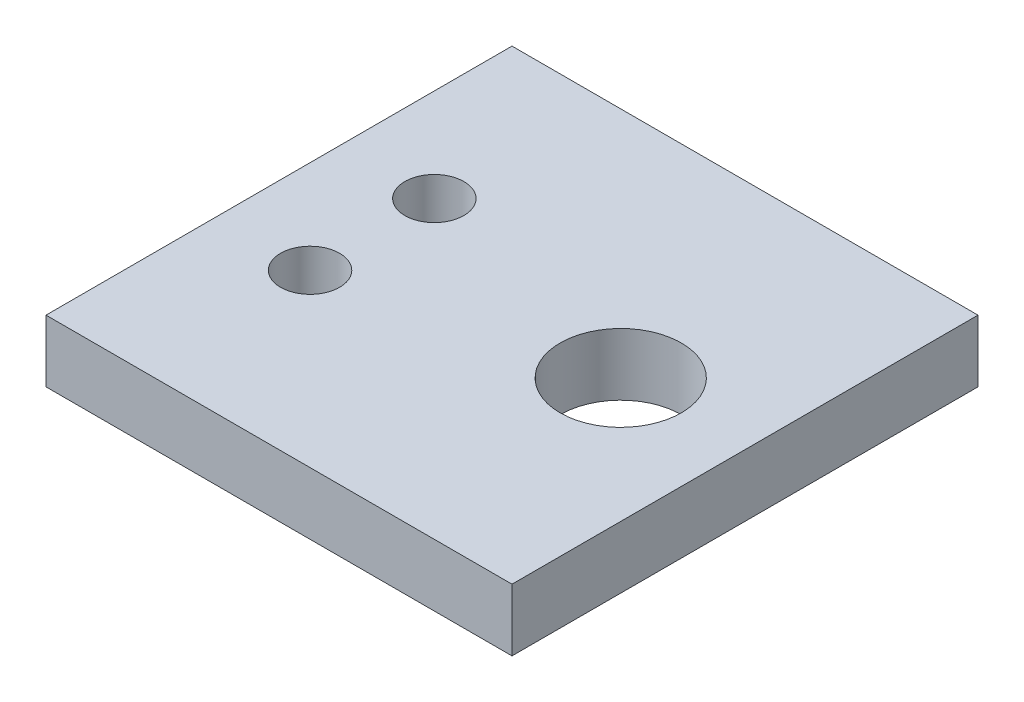
ISO-10303-21;
HEADER;
FILE_DESCRIPTION(('STEP AP214'),'2;1');
FILE_NAME('part.step','',(''),(''),'','','');
FILE_SCHEMA(('AUTOMOTIVE_DESIGN { 1 0 10303 214 1 1 1 1 }'));
ENDSEC;
DATA;
#1=APPLICATION_CONTEXT('core data for automotive mechanical design processes');
#2=APPLICATION_PROTOCOL_DEFINITION('international standard','automotive_design',2000,#1);
#3=PRODUCT_CONTEXT('',#1,'mechanical');
#4=PRODUCT('Part','Part','',(#3));
#5=PRODUCT_RELATED_PRODUCT_CATEGORY('part','',(#4));
#6=PRODUCT_DEFINITION_FORMATION('','',#4);
#7=PRODUCT_DEFINITION_CONTEXT('part definition',#1,'design');
#8=PRODUCT_DEFINITION('design','',#6,#7);
#9=PRODUCT_DEFINITION_SHAPE('','',#8);
#10=(LENGTH_UNIT() NAMED_UNIT(*) SI_UNIT(.MILLI.,.METRE.));
#11=(NAMED_UNIT(*) PLANE_ANGLE_UNIT() SI_UNIT($,.RADIAN.));
#12=(NAMED_UNIT(*) SI_UNIT($,.STERADIAN.) SOLID_ANGLE_UNIT());
#13=UNCERTAINTY_MEASURE_WITH_UNIT(LENGTH_MEASURE(1.E-05),#10,'distance_accuracy_value','');
#14=(GEOMETRIC_REPRESENTATION_CONTEXT(3) GLOBAL_UNCERTAINTY_ASSIGNED_CONTEXT((#13)) GLOBAL_UNIT_ASSIGNED_CONTEXT((#10,
#11,#12)) REPRESENTATION_CONTEXT('',''));
#15=CARTESIAN_POINT('',(0.,0.,0.));
#16=DIRECTION('',(0.,0.,1.));
#17=DIRECTION('',(1.,0.,0.));
#18=AXIS2_PLACEMENT_3D('',#15,#16,#17);
#19=CARTESIAN_POINT('',(7.5,2.,-7.5));
#20=DIRECTION('',(-1.,0.,0.));
#21=DIRECTION('',(0.,0.,1.));
#22=AXIS2_PLACEMENT_3D('',#19,#20,#21);
#23=PLANE('',#22);
#24=DIRECTION('',(0.,0.,-1.));
#25=VECTOR('',#24,1.);
#26=CARTESIAN_POINT('',(7.5,0.,-7.5));
#27=LINE('',#26,#25);
#28=CARTESIAN_POINT('',(7.5,0.,7.5));
#29=VERTEX_POINT('',#28);
#30=CARTESIAN_POINT('',(7.5,0.,-7.5));
#31=VERTEX_POINT('',#30);
#32=EDGE_CURVE('E107',#29,#31,#27,.T.);
#33=ORIENTED_EDGE('',*,*,#32,.T.);
#34=DIRECTION('',(0.,-1.,0.));
#35=VECTOR('',#34,1.);
#36=CARTESIAN_POINT('',(7.5,2.,-7.5));
#37=LINE('',#36,#35);
#38=CARTESIAN_POINT('',(7.5,2.,-7.5));
#39=VERTEX_POINT('',#38);
#40=EDGE_CURVE('E11',#39,#31,#37,.T.);
#41=ORIENTED_EDGE('',*,*,#40,.F.);
#42=DIRECTION('',(0.,0.,-1.));
#43=VECTOR('',#42,1.);
#44=CARTESIAN_POINT('',(7.5,2.,-7.5));
#45=LINE('',#44,#43);
#46=CARTESIAN_POINT('',(7.5,2.,7.5));
#47=VERTEX_POINT('',#46);
#48=EDGE_CURVE('E91',#47,#39,#45,.T.);
#49=ORIENTED_EDGE('',*,*,#48,.F.);
#50=DIRECTION('',(0.,-1.,0.));
#51=VECTOR('',#50,1.);
#52=CARTESIAN_POINT('',(7.5,2.,7.5));
#53=LINE('',#52,#51);
#54=EDGE_CURVE('E103',#47,#29,#53,.T.);
#55=ORIENTED_EDGE('',*,*,#54,.T.);
#56=EDGE_LOOP('',(#33,#41,#49,#55));
#57=FACE_BOUND('',#56,.T.);
#58=ADVANCED_FACE('F39',(#57),#23,.F.);
#59=CARTESIAN_POINT('',(-7.5,2.,-7.5));
#60=DIRECTION('',(0.,0.,1.));
#61=DIRECTION('',(1.,0.,0.));
#62=AXIS2_PLACEMENT_3D('',#59,#60,#61);
#63=PLANE('',#62);
#64=DIRECTION('',(-1.,0.,0.));
#65=VECTOR('',#64,1.);
#66=CARTESIAN_POINT('',(-7.5,0.,-7.5));
#67=LINE('',#66,#65);
#68=CARTESIAN_POINT('',(-7.5,0.,-7.5));
#69=VERTEX_POINT('',#68);
#70=EDGE_CURVE('E96',#31,#69,#67,.T.);
#71=ORIENTED_EDGE('',*,*,#70,.T.);
#72=DIRECTION('',(0.,-1.,0.));
#73=VECTOR('',#72,1.);
#74=CARTESIAN_POINT('',(-7.5,2.,-7.5));
#75=LINE('',#74,#73);
#76=CARTESIAN_POINT('',(-7.5,2.,-7.5));
#77=VERTEX_POINT('',#76);
#78=EDGE_CURVE('E48',#77,#69,#75,.T.);
#79=ORIENTED_EDGE('',*,*,#78,.F.);
#80=DIRECTION('',(-1.,0.,0.));
#81=VECTOR('',#80,1.);
#82=CARTESIAN_POINT('',(-7.5,2.,-7.5));
#83=LINE('',#82,#81);
#84=EDGE_CURVE('E86',#39,#77,#83,.T.);
#85=ORIENTED_EDGE('',*,*,#84,.F.);
#86=ORIENTED_EDGE('',*,*,#40,.T.);
#87=EDGE_LOOP('',(#71,#79,#85,#86));
#88=FACE_BOUND('',#87,.T.);
#89=ADVANCED_FACE('F95',(#88),#63,.F.);
#90=CARTESIAN_POINT('',(-7.5,2.,-7.5));
#91=DIRECTION('',(1.,0.,0.));
#92=DIRECTION('',(0.,0.,-1.));
#93=AXIS2_PLACEMENT_3D('',#90,#91,#92);
#94=PLANE('',#93);
#95=DIRECTION('',(0.,0.,1.));
#96=VECTOR('',#95,1.);
#97=CARTESIAN_POINT('',(-7.5,0.,-7.5));
#98=LINE('',#97,#96);
#99=CARTESIAN_POINT('',(-7.5,0.,7.5));
#100=VERTEX_POINT('',#99);
#101=EDGE_CURVE('E73',#69,#100,#98,.T.);
#102=ORIENTED_EDGE('',*,*,#101,.T.);
#103=DIRECTION('',(0.,-1.,0.));
#104=VECTOR('',#103,1.);
#105=CARTESIAN_POINT('',(-7.5,2.,7.5));
#106=LINE('',#105,#104);
#107=CARTESIAN_POINT('',(-7.5,2.,7.5));
#108=VERTEX_POINT('',#107);
#109=EDGE_CURVE('E98',#108,#100,#106,.T.);
#110=ORIENTED_EDGE('',*,*,#109,.F.);
#111=DIRECTION('',(0.,0.,1.));
#112=VECTOR('',#111,1.);
#113=CARTESIAN_POINT('',(-7.5,2.,-7.5));
#114=LINE('',#113,#112);
#115=EDGE_CURVE('E89',#77,#108,#114,.T.);
#116=ORIENTED_EDGE('',*,*,#115,.F.);
#117=ORIENTED_EDGE('',*,*,#78,.T.);
#118=EDGE_LOOP('',(#102,#110,#116,#117));
#119=FACE_BOUND('',#118,.T.);
#120=ADVANCED_FACE('F99',(#119),#94,.F.);
#121=CARTESIAN_POINT('',(-7.5,2.,7.5));
#122=DIRECTION('',(0.,0.,-1.));
#123=DIRECTION('',(-1.,0.,0.));
#124=AXIS2_PLACEMENT_3D('',#121,#122,#123);
#125=PLANE('',#124);
#126=DIRECTION('',(1.,0.,0.));
#127=VECTOR('',#126,1.);
#128=CARTESIAN_POINT('',(-7.5,0.,7.5));
#129=LINE('',#128,#127);
#130=EDGE_CURVE('E79',#100,#29,#129,.T.);
#131=ORIENTED_EDGE('',*,*,#130,.T.);
#132=ORIENTED_EDGE('',*,*,#54,.F.);
#133=DIRECTION('',(1.,0.,0.));
#134=VECTOR('',#133,1.);
#135=CARTESIAN_POINT('',(-7.5,2.,7.5));
#136=LINE('',#135,#134);
#137=EDGE_CURVE('E56',#108,#47,#136,.T.);
#138=ORIENTED_EDGE('',*,*,#137,.F.);
#139=ORIENTED_EDGE('',*,*,#109,.T.);
#140=EDGE_LOOP('',(#131,#132,#138,#139));
#141=FACE_BOUND('',#140,.T.);
#142=ADVANCED_FACE('F121',(#141),#125,.F.);
#143=CARTESIAN_POINT('',(0.,2.,0.));
#144=DIRECTION('',(0.,1.,0.));
#145=DIRECTION('',(0.,0.,1.));
#146=AXIS2_PLACEMENT_3D('',#143,#144,#145);
#147=PLANE('',#146);
#148=CARTESIAN_POINT('',(3.5,2.,0.));
#149=DIRECTION('',(0.,1.,0.));
#150=DIRECTION('',(0.,0.,1.));
#151=AXIS2_PLACEMENT_3D('',#148,#149,#150);
#152=CIRCLE('',#151,1.95);
#153=CARTESIAN_POINT('',(3.5,2.,1.95));
#154=VERTEX_POINT('',#153);
#155=EDGE_CURVE('E144',#154,#154,#152,.T.);
#156=ORIENTED_EDGE('',*,*,#155,.F.);
#157=EDGE_LOOP('',(#156));
#158=FACE_BOUND('',#157,.T.);
#159=CARTESIAN_POINT('',(-4.5,2.,2.));
#160=DIRECTION('',(0.,1.,0.));
#161=DIRECTION('',(0.,0.,1.));
#162=AXIS2_PLACEMENT_3D('',#159,#160,#161);
#163=CIRCLE('',#162,0.950000000000001);
#164=CARTESIAN_POINT('',(-4.5,2.,2.95));
#165=VERTEX_POINT('',#164);
#166=EDGE_CURVE('E137',#165,#165,#163,.T.);
#167=ORIENTED_EDGE('',*,*,#166,.F.);
#168=EDGE_LOOP('',(#167));
#169=FACE_BOUND('',#168,.T.);
#170=CARTESIAN_POINT('',(-4.50000000000001,2.,-2.));
#171=DIRECTION('',(0.,1.,0.));
#172=DIRECTION('',(0.,0.,1.));
#173=AXIS2_PLACEMENT_3D('',#170,#171,#172);
#174=CIRCLE('',#173,0.95);
#175=CARTESIAN_POINT('',(-4.50000000000001,2.,-1.05));
#176=VERTEX_POINT('',#175);
#177=EDGE_CURVE('E128',#176,#176,#174,.T.);
#178=ORIENTED_EDGE('',*,*,#177,.F.);
#179=EDGE_LOOP('',(#178));
#180=FACE_BOUND('',#179,.T.);
#181=ORIENTED_EDGE('',*,*,#48,.T.);
#182=ORIENTED_EDGE('',*,*,#84,.T.);
#183=ORIENTED_EDGE('',*,*,#115,.T.);
#184=ORIENTED_EDGE('',*,*,#137,.T.);
#185=EDGE_LOOP('',(#181,#182,#183,#184));
#186=FACE_BOUND('',#185,.T.);
#187=ADVANCED_FACE('F87',(#158,#169,#180,#186),#147,.T.);
#188=CARTESIAN_POINT('',(0.,0.,0.));
#189=DIRECTION('',(0.,1.,0.));
#190=DIRECTION('',(0.,0.,1.));
#191=AXIS2_PLACEMENT_3D('',#188,#189,#190);
#192=PLANE('',#191);
#193=CARTESIAN_POINT('',(3.5,0.,0.));
#194=DIRECTION('',(0.,1.,0.));
#195=DIRECTION('',(0.,0.,1.));
#196=AXIS2_PLACEMENT_3D('',#193,#194,#195);
#197=CIRCLE('',#196,1.95);
#198=CARTESIAN_POINT('',(3.5,0.,1.95));
#199=VERTEX_POINT('',#198);
#200=EDGE_CURVE('E133',#199,#199,#197,.T.);
#201=ORIENTED_EDGE('',*,*,#200,.T.);
#202=EDGE_LOOP('',(#201));
#203=FACE_BOUND('',#202,.T.);
#204=CARTESIAN_POINT('',(-4.5,0.,2.));
#205=DIRECTION('',(0.,1.,0.));
#206=DIRECTION('',(0.,0.,1.));
#207=AXIS2_PLACEMENT_3D('',#204,#205,#206);
#208=CIRCLE('',#207,0.950000000000001);
#209=CARTESIAN_POINT('',(-4.5,0.,2.95));
#210=VERTEX_POINT('',#209);
#211=EDGE_CURVE('E111',#210,#210,#208,.T.);
#212=ORIENTED_EDGE('',*,*,#211,.T.);
#213=EDGE_LOOP('',(#212));
#214=FACE_BOUND('',#213,.T.);
#215=CARTESIAN_POINT('',(-4.50000000000001,0.,-2.));
#216=DIRECTION('',(0.,1.,0.));
#217=DIRECTION('',(0.,0.,1.));
#218=AXIS2_PLACEMENT_3D('',#215,#216,#217);
#219=CIRCLE('',#218,0.95);
#220=CARTESIAN_POINT('',(-4.50000000000001,0.,-1.05));
#221=VERTEX_POINT('',#220);
#222=EDGE_CURVE('E132',#221,#221,#219,.T.);
#223=ORIENTED_EDGE('',*,*,#222,.T.);
#224=EDGE_LOOP('',(#223));
#225=FACE_BOUND('',#224,.T.);
#226=ORIENTED_EDGE('',*,*,#32,.F.);
#227=ORIENTED_EDGE('',*,*,#130,.F.);
#228=ORIENTED_EDGE('',*,*,#101,.F.);
#229=ORIENTED_EDGE('',*,*,#70,.F.);
#230=EDGE_LOOP('',(#226,#227,#228,#229));
#231=FACE_BOUND('',#230,.T.);
#232=ADVANCED_FACE('F124',(#203,#214,#225,#231),#192,.F.);
#233=CARTESIAN_POINT('',(-4.50000000000001,0.,-2.));
#234=DIRECTION('',(0.,1.,0.));
#235=DIRECTION('',(0.,0.,1.));
#236=AXIS2_PLACEMENT_3D('',#233,#234,#235);
#237=CYLINDRICAL_SURFACE('',#236,0.95);
#238=ORIENTED_EDGE('',*,*,#222,.F.);
#239=EDGE_LOOP('',(#238));
#240=FACE_BOUND('',#239,.T.);
#241=ORIENTED_EDGE('',*,*,#177,.T.);
#242=EDGE_LOOP('',(#241));
#243=FACE_BOUND('',#242,.T.);
#244=ADVANCED_FACE('F168',(#240,#243),#237,.F.);
#245=CARTESIAN_POINT('',(-4.5,0.,2.));
#246=DIRECTION('',(0.,1.,0.));
#247=DIRECTION('',(0.,0.,1.));
#248=AXIS2_PLACEMENT_3D('',#245,#246,#247);
#249=CYLINDRICAL_SURFACE('',#248,0.950000000000001);
#250=ORIENTED_EDGE('',*,*,#211,.F.);
#251=EDGE_LOOP('',(#250));
#252=FACE_BOUND('',#251,.T.);
#253=ORIENTED_EDGE('',*,*,#166,.T.);
#254=EDGE_LOOP('',(#253));
#255=FACE_BOUND('',#254,.T.);
#256=ADVANCED_FACE('F157',(#252,#255),#249,.F.);
#257=CARTESIAN_POINT('',(3.5,0.,0.));
#258=DIRECTION('',(0.,1.,0.));
#259=DIRECTION('',(0.,0.,1.));
#260=AXIS2_PLACEMENT_3D('',#257,#258,#259);
#261=CYLINDRICAL_SURFACE('',#260,1.95);
#262=ORIENTED_EDGE('',*,*,#200,.F.);
#263=EDGE_LOOP('',(#262));
#264=FACE_BOUND('',#263,.T.);
#265=ORIENTED_EDGE('',*,*,#155,.T.);
#266=EDGE_LOOP('',(#265));
#267=FACE_BOUND('',#266,.T.);
#268=ADVANCED_FACE('F154',(#264,#267),#261,.F.);
#269=CLOSED_SHELL('',(#58,#89,#120,#142,#187,#232,#244,#256,#268));
#270=MANIFOLD_SOLID_BREP('B2',#269);
#271=ADVANCED_BREP_SHAPE_REPRESENTATION('',(#18,#270),#14);
#272=SHAPE_DEFINITION_REPRESENTATION(#9,#271);
ENDSEC;
END-ISO-10303-21;
